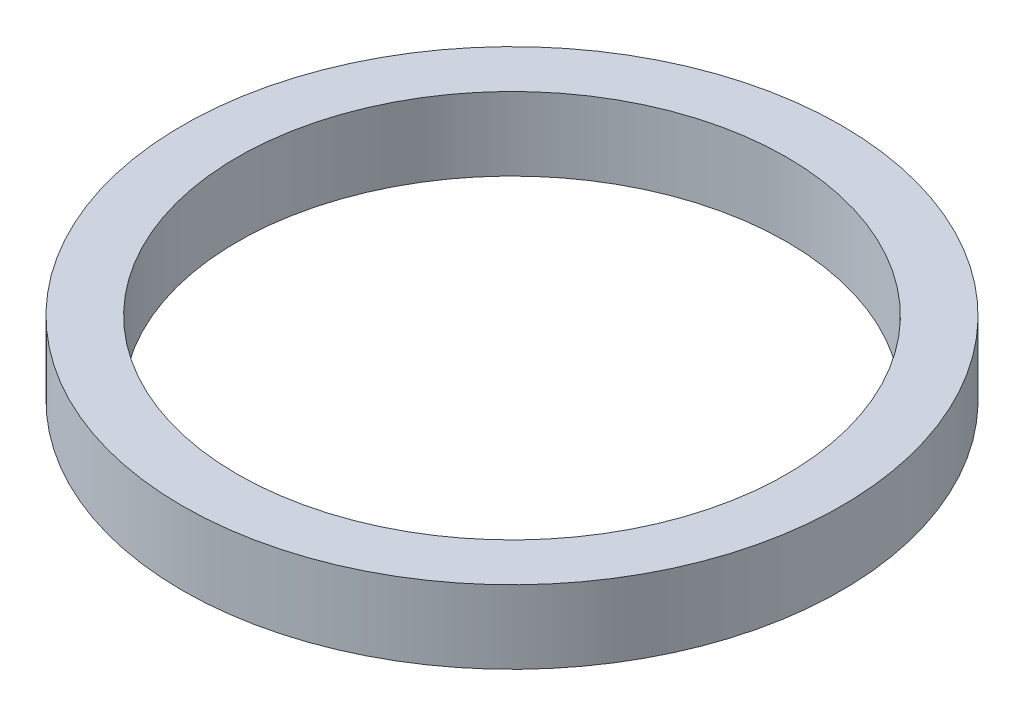
ISO-10303-21;
HEADER;
FILE_DESCRIPTION(('STEP AP214'),'2;1');
FILE_NAME('part.step','',(''),(''),'','','');
FILE_SCHEMA(('AUTOMOTIVE_DESIGN { 1 0 10303 214 1 1 1 1 }'));
ENDSEC;
DATA;
#1=APPLICATION_CONTEXT('core data for automotive mechanical design processes');
#2=APPLICATION_PROTOCOL_DEFINITION('international standard','automotive_design',2000,#1);
#3=PRODUCT_CONTEXT('',#1,'mechanical');
#4=PRODUCT('Part','Part','',(#3));
#5=PRODUCT_RELATED_PRODUCT_CATEGORY('part','',(#4));
#6=PRODUCT_DEFINITION_FORMATION('','',#4);
#7=PRODUCT_DEFINITION_CONTEXT('part definition',#1,'design');
#8=PRODUCT_DEFINITION('design','',#6,#7);
#9=PRODUCT_DEFINITION_SHAPE('','',#8);
#10=(LENGTH_UNIT() NAMED_UNIT(*) SI_UNIT(.MILLI.,.METRE.));
#11=(NAMED_UNIT(*) PLANE_ANGLE_UNIT() SI_UNIT($,.RADIAN.));
#12=(NAMED_UNIT(*) SI_UNIT($,.STERADIAN.) SOLID_ANGLE_UNIT());
#13=UNCERTAINTY_MEASURE_WITH_UNIT(LENGTH_MEASURE(1.E-05),#10,'distance_accuracy_value','');
#14=(GEOMETRIC_REPRESENTATION_CONTEXT(3) GLOBAL_UNCERTAINTY_ASSIGNED_CONTEXT((#13)) GLOBAL_UNIT_ASSIGNED_CONTEXT((#10,
#11,#12)) REPRESENTATION_CONTEXT('',''));
#15=CARTESIAN_POINT('',(0.,0.,0.));
#16=DIRECTION('',(0.,0.,1.));
#17=DIRECTION('',(1.,0.,0.));
#18=AXIS2_PLACEMENT_3D('',#15,#16,#17);
#19=CARTESIAN_POINT('',(0.,10.,0.));
#20=DIRECTION('',(0.,-1.,0.));
#21=DIRECTION('',(0.,0.,-1.));
#22=AXIS2_PLACEMENT_3D('',#19,#20,#21);
#23=CYLINDRICAL_SURFACE('',#22,45.);
#24=CARTESIAN_POINT('',(0.,10.,0.));
#25=DIRECTION('',(0.,1.,0.));
#26=DIRECTION('',(0.,0.,1.));
#27=AXIS2_PLACEMENT_3D('',#24,#25,#26);
#28=CIRCLE('',#27,45.);
#29=CARTESIAN_POINT('',(0.,10.,45.));
#30=VERTEX_POINT('',#29);
#31=EDGE_CURVE('E10',#30,#30,#28,.T.);
#32=ORIENTED_EDGE('',*,*,#31,.F.);
#33=EDGE_LOOP('',(#32));
#34=FACE_BOUND('',#33,.T.);
#35=CARTESIAN_POINT('',(0.,0.,0.));
#36=DIRECTION('',(0.,1.,0.));
#37=DIRECTION('',(0.,0.,1.));
#38=AXIS2_PLACEMENT_3D('',#35,#36,#37);
#39=CIRCLE('',#38,45.);
#40=CARTESIAN_POINT('',(0.,0.,45.));
#41=VERTEX_POINT('',#40);
#42=EDGE_CURVE('E37',#41,#41,#39,.T.);
#43=ORIENTED_EDGE('',*,*,#42,.T.);
#44=EDGE_LOOP('',(#43));
#45=FACE_BOUND('',#44,.T.);
#46=ADVANCED_FACE('F40',(#34,#45),#23,.T.);
#47=CARTESIAN_POINT('',(0.,10.,0.));
#48=DIRECTION('',(0.,1.,0.));
#49=DIRECTION('',(0.,0.,1.));
#50=AXIS2_PLACEMENT_3D('',#47,#48,#49);
#51=PLANE('',#50);
#52=CARTESIAN_POINT('',(0.,10.,0.));
#53=DIRECTION('',(0.,1.,0.));
#54=DIRECTION('',(0.,0.,1.));
#55=AXIS2_PLACEMENT_3D('',#52,#53,#54);
#56=CIRCLE('',#55,37.5);
#57=CARTESIAN_POINT('',(0.,10.,37.5));
#58=VERTEX_POINT('',#57);
#59=EDGE_CURVE('E50',#58,#58,#56,.T.);
#60=ORIENTED_EDGE('',*,*,#59,.F.);
#61=EDGE_LOOP('',(#60));
#62=FACE_BOUND('',#61,.T.);
#63=ORIENTED_EDGE('',*,*,#31,.T.);
#64=EDGE_LOOP('',(#63));
#65=FACE_BOUND('',#64,.T.);
#66=ADVANCED_FACE('F59',(#62,#65),#51,.T.);
#67=CARTESIAN_POINT('',(0.,0.,0.));
#68=DIRECTION('',(0.,1.,0.));
#69=DIRECTION('',(0.,0.,1.));
#70=AXIS2_PLACEMENT_3D('',#67,#68,#69);
#71=PLANE('',#70);
#72=CARTESIAN_POINT('',(0.,0.,0.));
#73=DIRECTION('',(0.,1.,0.));
#74=DIRECTION('',(0.,0.,1.));
#75=AXIS2_PLACEMENT_3D('',#72,#73,#74);
#76=CIRCLE('',#75,37.5);
#77=CARTESIAN_POINT('',(0.,0.,37.5));
#78=VERTEX_POINT('',#77);
#79=EDGE_CURVE('E47',#78,#78,#76,.T.);
#80=ORIENTED_EDGE('',*,*,#79,.T.);
#81=EDGE_LOOP('',(#80));
#82=FACE_BOUND('',#81,.T.);
#83=ORIENTED_EDGE('',*,*,#42,.F.);
#84=EDGE_LOOP('',(#83));
#85=FACE_BOUND('',#84,.T.);
#86=ADVANCED_FACE('F58',(#82,#85),#71,.F.);
#87=CARTESIAN_POINT('',(0.,10.,0.));
#88=DIRECTION('',(0.,-1.,0.));
#89=DIRECTION('',(0.,0.,-1.));
#90=AXIS2_PLACEMENT_3D('',#87,#88,#89);
#91=CYLINDRICAL_SURFACE('',#90,37.5);
#92=ORIENTED_EDGE('',*,*,#59,.T.);
#93=EDGE_LOOP('',(#92));
#94=FACE_BOUND('',#93,.T.);
#95=ORIENTED_EDGE('',*,*,#79,.F.);
#96=EDGE_LOOP('',(#95));
#97=FACE_BOUND('',#96,.T.);
#98=ADVANCED_FACE('F54',(#94,#97),#91,.F.);
#99=CLOSED_SHELL('',(#46,#66,#86,#98));
#100=MANIFOLD_SOLID_BREP('B2',#99);
#101=ADVANCED_BREP_SHAPE_REPRESENTATION('',(#18,#100),#14);
#102=SHAPE_DEFINITION_REPRESENTATION(#9,#101);
ENDSEC;
END-ISO-10303-21;
